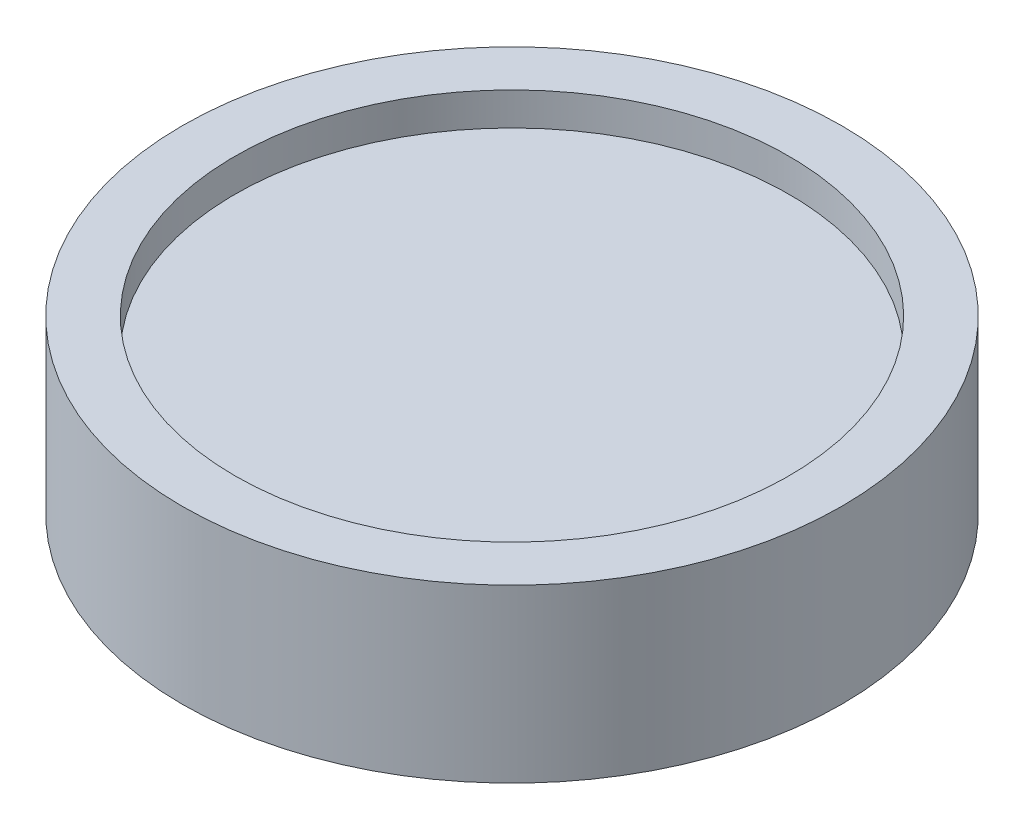
ISO-10303-21;
HEADER;
FILE_DESCRIPTION(('STEP AP214'),'2;1');
FILE_NAME('part.step','',(''),(''),'','','');
FILE_SCHEMA(('AUTOMOTIVE_DESIGN { 1 0 10303 214 1 1 1 1 }'));
ENDSEC;
DATA;
#1=APPLICATION_CONTEXT('core data for automotive mechanical design processes');
#2=APPLICATION_PROTOCOL_DEFINITION('international standard','automotive_design',2000,#1);
#3=PRODUCT_CONTEXT('',#1,'mechanical');
#4=PRODUCT('Part','Part','',(#3));
#5=PRODUCT_RELATED_PRODUCT_CATEGORY('part','',(#4));
#6=PRODUCT_DEFINITION_FORMATION('','',#4);
#7=PRODUCT_DEFINITION_CONTEXT('part definition',#1,'design');
#8=PRODUCT_DEFINITION('design','',#6,#7);
#9=PRODUCT_DEFINITION_SHAPE('','',#8);
#10=(LENGTH_UNIT() NAMED_UNIT(*) SI_UNIT(.MILLI.,.METRE.));
#11=(NAMED_UNIT(*) PLANE_ANGLE_UNIT() SI_UNIT($,.RADIAN.));
#12=(NAMED_UNIT(*) SI_UNIT($,.STERADIAN.) SOLID_ANGLE_UNIT());
#13=UNCERTAINTY_MEASURE_WITH_UNIT(LENGTH_MEASURE(1.E-05),#10,'distance_accuracy_value','');
#14=(GEOMETRIC_REPRESENTATION_CONTEXT(3) GLOBAL_UNCERTAINTY_ASSIGNED_CONTEXT((#13)) GLOBAL_UNIT_ASSIGNED_CONTEXT((#10,
#11,#12)) REPRESENTATION_CONTEXT('',''));
#15=CARTESIAN_POINT('',(0.,0.,0.));
#16=DIRECTION('',(0.,0.,1.));
#17=DIRECTION('',(1.,0.,0.));
#18=AXIS2_PLACEMENT_3D('',#15,#16,#17);
#19=CARTESIAN_POINT('',(0.,26.,0.));
#20=DIRECTION('',(0.,-1.,0.));
#21=DIRECTION('',(0.,0.,-1.));
#22=AXIS2_PLACEMENT_3D('',#19,#20,#21);
#23=CYLINDRICAL_SURFACE('',#22,50.);
#24=CARTESIAN_POINT('',(0.,26.,0.));
#25=DIRECTION('',(0.,1.,0.));
#26=DIRECTION('',(0.,0.,1.));
#27=AXIS2_PLACEMENT_3D('',#24,#25,#26);
#28=CIRCLE('',#27,50.);
#29=CARTESIAN_POINT('',(0.,26.,50.));
#30=VERTEX_POINT('',#29);
#31=EDGE_CURVE('E38',#30,#30,#28,.T.);
#32=ORIENTED_EDGE('',*,*,#31,.F.);
#33=EDGE_LOOP('',(#32));
#34=FACE_BOUND('',#33,.T.);
#35=CARTESIAN_POINT('',(0.,0.,0.));
#36=DIRECTION('',(0.,1.,0.));
#37=DIRECTION('',(0.,0.,1.));
#38=AXIS2_PLACEMENT_3D('',#35,#36,#37);
#39=CIRCLE('',#38,50.);
#40=CARTESIAN_POINT('',(0.,0.,50.));
#41=VERTEX_POINT('',#40);
#42=EDGE_CURVE('E42',#41,#41,#39,.T.);
#43=ORIENTED_EDGE('',*,*,#42,.T.);
#44=EDGE_LOOP('',(#43));
#45=FACE_BOUND('',#44,.T.);
#46=ADVANCED_FACE('F32',(#34,#45),#23,.T.);
#47=CARTESIAN_POINT('',(0.,26.,0.));
#48=DIRECTION('',(0.,1.,0.));
#49=DIRECTION('',(0.,0.,1.));
#50=AXIS2_PLACEMENT_3D('',#47,#48,#49);
#51=PLANE('',#50);
#52=CARTESIAN_POINT('',(0.,26.,0.));
#53=DIRECTION('',(0.,1.,0.));
#54=DIRECTION('',(0.,0.,1.));
#55=AXIS2_PLACEMENT_3D('',#52,#53,#54);
#56=CIRCLE('',#55,42.);
#57=CARTESIAN_POINT('',(0.,26.,42.));
#58=VERTEX_POINT('',#57);
#59=EDGE_CURVE('E49',#58,#58,#56,.T.);
#60=ORIENTED_EDGE('',*,*,#59,.F.);
#61=EDGE_LOOP('',(#60));
#62=FACE_BOUND('',#61,.T.);
#63=ORIENTED_EDGE('',*,*,#31,.T.);
#64=EDGE_LOOP('',(#63));
#65=FACE_BOUND('',#64,.T.);
#66=ADVANCED_FACE('F73',(#62,#65),#51,.T.);
#67=CARTESIAN_POINT('',(0.,0.,0.));
#68=DIRECTION('',(0.,1.,0.));
#69=DIRECTION('',(0.,0.,1.));
#70=AXIS2_PLACEMENT_3D('',#67,#68,#69);
#71=PLANE('',#70);
#72=CARTESIAN_POINT('',(0.,0.,0.));
#73=DIRECTION('',(0.,1.,0.));
#74=DIRECTION('',(0.,0.,1.));
#75=AXIS2_PLACEMENT_3D('',#72,#73,#74);
#76=CIRCLE('',#75,5.);
#77=CARTESIAN_POINT('',(0.,0.,5.));
#78=VERTEX_POINT('',#77);
#79=EDGE_CURVE('E10',#78,#78,#76,.F.);
#80=ORIENTED_EDGE('',*,*,#79,.F.);
#81=EDGE_LOOP('',(#80));
#82=FACE_BOUND('',#81,.T.);
#83=ORIENTED_EDGE('',*,*,#42,.F.);
#84=EDGE_LOOP('',(#83));
#85=FACE_BOUND('',#84,.T.);
#86=ADVANCED_FACE('F78',(#82,#85),#71,.F.);
#87=CARTESIAN_POINT('',(0.,21.,0.));
#88=DIRECTION('',(0.,1.,0.));
#89=DIRECTION('',(0.,0.,1.));
#90=AXIS2_PLACEMENT_3D('',#87,#88,#89);
#91=CYLINDRICAL_SURFACE('',#90,42.);
#92=CARTESIAN_POINT('',(0.,21.,0.));
#93=DIRECTION('',(0.,1.,0.));
#94=DIRECTION('',(0.,0.,1.));
#95=AXIS2_PLACEMENT_3D('',#92,#93,#94);
#96=CIRCLE('',#95,42.);
#97=CARTESIAN_POINT('',(0.,21.,42.));
#98=VERTEX_POINT('',#97);
#99=EDGE_CURVE('E47',#98,#98,#96,.T.);
#100=ORIENTED_EDGE('',*,*,#99,.F.);
#101=EDGE_LOOP('',(#100));
#102=FACE_BOUND('',#101,.T.);
#103=ORIENTED_EDGE('',*,*,#59,.T.);
#104=EDGE_LOOP('',(#103));
#105=FACE_BOUND('',#104,.T.);
#106=ADVANCED_FACE('F69',(#102,#105),#91,.F.);
#107=CARTESIAN_POINT('',(0.,21.,0.));
#108=DIRECTION('',(0.,1.,0.));
#109=DIRECTION('',(0.,0.,1.));
#110=AXIS2_PLACEMENT_3D('',#107,#108,#109);
#111=PLANE('',#110);
#112=ORIENTED_EDGE('',*,*,#99,.T.);
#113=EDGE_LOOP('',(#112));
#114=FACE_BOUND('',#113,.T.);
#115=ADVANCED_FACE('F62',(#114),#111,.T.);
#116=CARTESIAN_POINT('',(0.,-10.,0.));
#117=DIRECTION('',(0.,1.,0.));
#118=DIRECTION('',(0.,0.,1.));
#119=AXIS2_PLACEMENT_3D('',#116,#117,#118);
#120=CYLINDRICAL_SURFACE('',#119,5.);
#121=CARTESIAN_POINT('',(0.,-10.,0.));
#122=DIRECTION('',(0.,-1.,0.));
#123=DIRECTION('',(0.,0.,-1.));
#124=AXIS2_PLACEMENT_3D('',#121,#122,#123);
#125=CIRCLE('',#124,5.);
#126=CARTESIAN_POINT('',(0.,-10.,-5.));
#127=VERTEX_POINT('',#126);
#128=EDGE_CURVE('E52',#127,#127,#125,.T.);
#129=ORIENTED_EDGE('',*,*,#128,.F.);
#130=EDGE_LOOP('',(#129));
#131=FACE_BOUND('',#130,.T.);
#132=ORIENTED_EDGE('',*,*,#79,.T.);
#133=EDGE_LOOP('',(#132));
#134=FACE_BOUND('',#133,.T.);
#135=ADVANCED_FACE('F60',(#131,#134),#120,.T.);
#136=CARTESIAN_POINT('',(0.,-10.,0.));
#137=DIRECTION('',(0.,-1.,0.));
#138=DIRECTION('',(0.,0.,-1.));
#139=AXIS2_PLACEMENT_3D('',#136,#137,#138);
#140=PLANE('',#139);
#141=ORIENTED_EDGE('',*,*,#128,.T.);
#142=EDGE_LOOP('',(#141));
#143=FACE_BOUND('',#142,.T.);
#144=ADVANCED_FACE('F58',(#143),#140,.T.);
#145=CLOSED_SHELL('',(#46,#66,#86,#106,#115,#135,#144));
#146=MANIFOLD_SOLID_BREP('B2',#145);
#147=ADVANCED_BREP_SHAPE_REPRESENTATION('',(#18,#146),#14);
#148=SHAPE_DEFINITION_REPRESENTATION(#9,#147);
ENDSEC;
END-ISO-10303-21;
